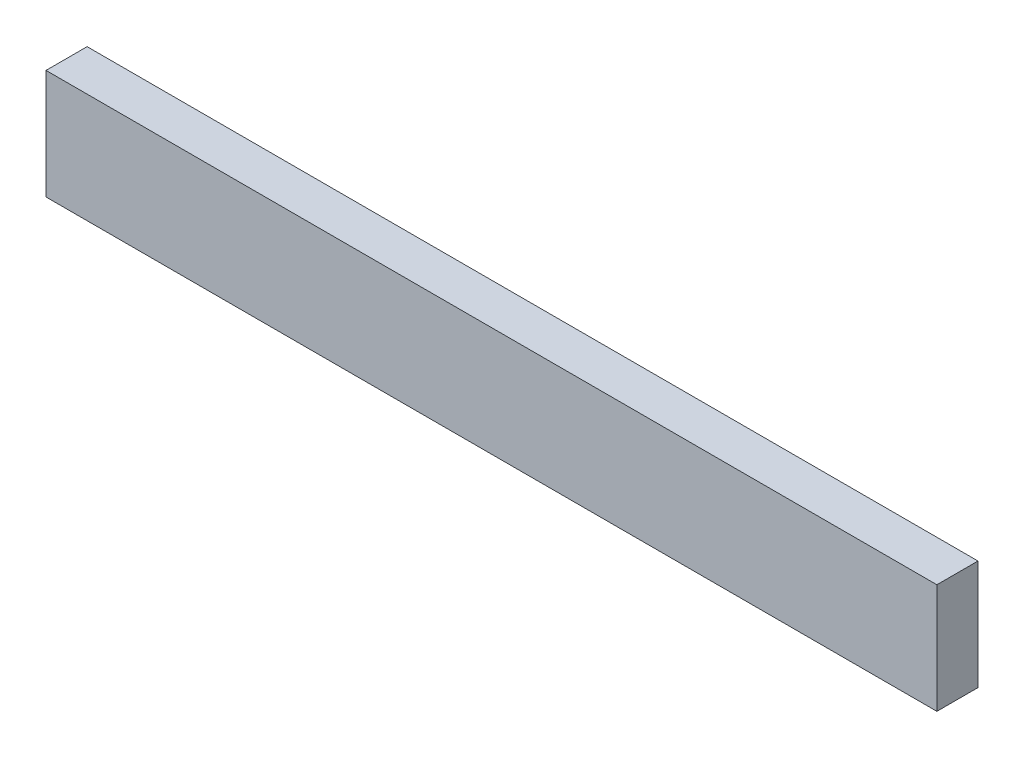
ISO-10303-21;
HEADER;
FILE_DESCRIPTION(('STEP AP214'),'2;1');
FILE_NAME('part.step','',(''),(''),'','','');
FILE_SCHEMA(('AUTOMOTIVE_DESIGN { 1 0 10303 214 1 1 1 1 }'));
ENDSEC;
DATA;
#1=APPLICATION_CONTEXT('core data for automotive mechanical design processes');
#2=APPLICATION_PROTOCOL_DEFINITION('international standard','automotive_design',2000,#1);
#3=PRODUCT_CONTEXT('',#1,'mechanical');
#4=PRODUCT('Part','Part','',(#3));
#5=PRODUCT_RELATED_PRODUCT_CATEGORY('part','',(#4));
#6=PRODUCT_DEFINITION_FORMATION('','',#4);
#7=PRODUCT_DEFINITION_CONTEXT('part definition',#1,'design');
#8=PRODUCT_DEFINITION('design','',#6,#7);
#9=PRODUCT_DEFINITION_SHAPE('','',#8);
#10=(LENGTH_UNIT() NAMED_UNIT(*) SI_UNIT(.MILLI.,.METRE.));
#11=(NAMED_UNIT(*) PLANE_ANGLE_UNIT() SI_UNIT($,.RADIAN.));
#12=(NAMED_UNIT(*) SI_UNIT($,.STERADIAN.) SOLID_ANGLE_UNIT());
#13=UNCERTAINTY_MEASURE_WITH_UNIT(LENGTH_MEASURE(1.E-05),#10,'distance_accuracy_value','');
#14=(GEOMETRIC_REPRESENTATION_CONTEXT(3) GLOBAL_UNCERTAINTY_ASSIGNED_CONTEXT((#13)) GLOBAL_UNIT_ASSIGNED_CONTEXT((#10,
#11,#12)) REPRESENTATION_CONTEXT('',''));
#15=CARTESIAN_POINT('',(0.,0.,0.));
#16=DIRECTION('',(0.,0.,1.));
#17=DIRECTION('',(1.,0.,0.));
#18=AXIS2_PLACEMENT_3D('',#15,#16,#17);
#19=CARTESIAN_POINT('',(-325.,-40.,30.));
#20=DIRECTION('',(1.,0.,0.));
#21=DIRECTION('',(0.,0.,-1.));
#22=AXIS2_PLACEMENT_3D('',#19,#20,#21);
#23=PLANE('',#22);
#24=DIRECTION('',(0.,-1.,0.));
#25=VECTOR('',#24,1.);
#26=CARTESIAN_POINT('',(-325.,-40.,0.));
#27=LINE('',#26,#25);
#28=CARTESIAN_POINT('',(-325.,40.,0.));
#29=VERTEX_POINT('',#28);
#30=CARTESIAN_POINT('',(-325.,-40.,0.));
#31=VERTEX_POINT('',#30);
#32=EDGE_CURVE('E105',#29,#31,#27,.T.);
#33=ORIENTED_EDGE('',*,*,#32,.T.);
#34=DIRECTION('',(0.,0.,-1.));
#35=VECTOR('',#34,1.);
#36=CARTESIAN_POINT('',(-325.,-40.,30.));
#37=LINE('',#36,#35);
#38=CARTESIAN_POINT('',(-325.,-40.,30.));
#39=VERTEX_POINT('',#38);
#40=EDGE_CURVE('E11',#39,#31,#37,.T.);
#41=ORIENTED_EDGE('',*,*,#40,.F.);
#42=DIRECTION('',(0.,-1.,0.));
#43=VECTOR('',#42,1.);
#44=CARTESIAN_POINT('',(-325.,-40.,30.));
#45=LINE('',#44,#43);
#46=CARTESIAN_POINT('',(-325.,40.,30.));
#47=VERTEX_POINT('',#46);
#48=EDGE_CURVE('E89',#47,#39,#45,.T.);
#49=ORIENTED_EDGE('',*,*,#48,.F.);
#50=DIRECTION('',(0.,0.,-1.));
#51=VECTOR('',#50,1.);
#52=CARTESIAN_POINT('',(-325.,40.,30.));
#53=LINE('',#52,#51);
#54=EDGE_CURVE('E97',#47,#29,#53,.T.);
#55=ORIENTED_EDGE('',*,*,#54,.T.);
#56=EDGE_LOOP('',(#33,#41,#49,#55));
#57=FACE_BOUND('',#56,.T.);
#58=ADVANCED_FACE('F39',(#57),#23,.F.);
#59=CARTESIAN_POINT('',(-325.,-40.,30.));
#60=DIRECTION('',(0.,1.,0.));
#61=DIRECTION('',(0.,0.,1.));
#62=AXIS2_PLACEMENT_3D('',#59,#60,#61);
#63=PLANE('',#62);
#64=DIRECTION('',(1.,0.,0.));
#65=VECTOR('',#64,1.);
#66=CARTESIAN_POINT('',(-325.,-40.,0.));
#67=LINE('',#66,#65);
#68=CARTESIAN_POINT('',(325.,-40.,0.));
#69=VERTEX_POINT('',#68);
#70=EDGE_CURVE('E92',#31,#69,#67,.T.);
#71=ORIENTED_EDGE('',*,*,#70,.T.);
#72=DIRECTION('',(0.,0.,-1.));
#73=VECTOR('',#72,1.);
#74=CARTESIAN_POINT('',(325.,-40.,30.));
#75=LINE('',#74,#73);
#76=CARTESIAN_POINT('',(325.,-40.,30.));
#77=VERTEX_POINT('',#76);
#78=EDGE_CURVE('E50',#77,#69,#75,.T.);
#79=ORIENTED_EDGE('',*,*,#78,.F.);
#80=DIRECTION('',(1.,0.,0.));
#81=VECTOR('',#80,1.);
#82=CARTESIAN_POINT('',(-325.,-40.,30.));
#83=LINE('',#82,#81);
#84=EDGE_CURVE('E82',#39,#77,#83,.T.);
#85=ORIENTED_EDGE('',*,*,#84,.F.);
#86=ORIENTED_EDGE('',*,*,#40,.T.);
#87=EDGE_LOOP('',(#71,#79,#85,#86));
#88=FACE_BOUND('',#87,.T.);
#89=ADVANCED_FACE('F93',(#88),#63,.F.);
#90=CARTESIAN_POINT('',(325.,-40.,30.));
#91=DIRECTION('',(-1.,0.,0.));
#92=DIRECTION('',(0.,-1.,0.));
#93=AXIS2_PLACEMENT_3D('',#90,#91,#92);
#94=PLANE('',#93);
#95=DIRECTION('',(0.,1.,0.));
#96=VECTOR('',#95,1.);
#97=CARTESIAN_POINT('',(325.,-40.,0.));
#98=LINE('',#97,#96);
#99=CARTESIAN_POINT('',(325.,40.,0.));
#100=VERTEX_POINT('',#99);
#101=EDGE_CURVE('E75',#69,#100,#98,.T.);
#102=ORIENTED_EDGE('',*,*,#101,.T.);
#103=DIRECTION('',(0.,0.,-1.));
#104=VECTOR('',#103,1.);
#105=CARTESIAN_POINT('',(325.,40.,30.));
#106=LINE('',#105,#104);
#107=CARTESIAN_POINT('',(325.,40.,30.));
#108=VERTEX_POINT('',#107);
#109=EDGE_CURVE('E94',#108,#100,#106,.T.);
#110=ORIENTED_EDGE('',*,*,#109,.F.);
#111=DIRECTION('',(0.,1.,0.));
#112=VECTOR('',#111,1.);
#113=CARTESIAN_POINT('',(325.,-40.,30.));
#114=LINE('',#113,#112);
#115=EDGE_CURVE('E88',#77,#108,#114,.T.);
#116=ORIENTED_EDGE('',*,*,#115,.F.);
#117=ORIENTED_EDGE('',*,*,#78,.T.);
#118=EDGE_LOOP('',(#102,#110,#116,#117));
#119=FACE_BOUND('',#118,.T.);
#120=ADVANCED_FACE('F96',(#119),#94,.F.);
#121=CARTESIAN_POINT('',(-325.,40.,30.));
#122=DIRECTION('',(0.,-1.,0.));
#123=DIRECTION('',(0.,0.,-1.));
#124=AXIS2_PLACEMENT_3D('',#121,#122,#123);
#125=PLANE('',#124);
#126=DIRECTION('',(-1.,0.,0.));
#127=VECTOR('',#126,1.);
#128=CARTESIAN_POINT('',(-325.,40.,0.));
#129=LINE('',#128,#127);
#130=EDGE_CURVE('E76',#100,#29,#129,.T.);
#131=ORIENTED_EDGE('',*,*,#130,.T.);
#132=ORIENTED_EDGE('',*,*,#54,.F.);
#133=DIRECTION('',(-1.,0.,0.));
#134=VECTOR('',#133,1.);
#135=CARTESIAN_POINT('',(-325.,40.,30.));
#136=LINE('',#135,#134);
#137=EDGE_CURVE('E54',#108,#47,#136,.T.);
#138=ORIENTED_EDGE('',*,*,#137,.F.);
#139=ORIENTED_EDGE('',*,*,#109,.T.);
#140=EDGE_LOOP('',(#131,#132,#138,#139));
#141=FACE_BOUND('',#140,.T.);
#142=ADVANCED_FACE('F106',(#141),#125,.F.);
#143=CARTESIAN_POINT('',(0.,0.,30.));
#144=DIRECTION('',(0.,0.,-1.));
#145=DIRECTION('',(-1.,0.,0.));
#146=AXIS2_PLACEMENT_3D('',#143,#144,#145);
#147=PLANE('',#146);
#148=ORIENTED_EDGE('',*,*,#48,.T.);
#149=ORIENTED_EDGE('',*,*,#84,.T.);
#150=ORIENTED_EDGE('',*,*,#115,.T.);
#151=ORIENTED_EDGE('',*,*,#137,.T.);
#152=EDGE_LOOP('',(#148,#149,#150,#151));
#153=FACE_BOUND('',#152,.T.);
#154=ADVANCED_FACE('F86',(#153),#147,.F.);
#155=CARTESIAN_POINT('',(0.,0.,0.));
#156=DIRECTION('',(0.,0.,-1.));
#157=DIRECTION('',(-1.,0.,0.));
#158=AXIS2_PLACEMENT_3D('',#155,#156,#157);
#159=PLANE('',#158);
#160=ORIENTED_EDGE('',*,*,#32,.F.);
#161=ORIENTED_EDGE('',*,*,#130,.F.);
#162=ORIENTED_EDGE('',*,*,#101,.F.);
#163=ORIENTED_EDGE('',*,*,#70,.F.);
#164=EDGE_LOOP('',(#160,#161,#162,#163));
#165=FACE_BOUND('',#164,.T.);
#166=ADVANCED_FACE('F115',(#165),#159,.T.);
#167=CLOSED_SHELL('',(#58,#89,#120,#142,#154,#166));
#168=MANIFOLD_SOLID_BREP('B2',#167);
#169=ADVANCED_BREP_SHAPE_REPRESENTATION('',(#18,#168),#14);
#170=SHAPE_DEFINITION_REPRESENTATION(#9,#169);
ENDSEC;
END-ISO-10303-21;
